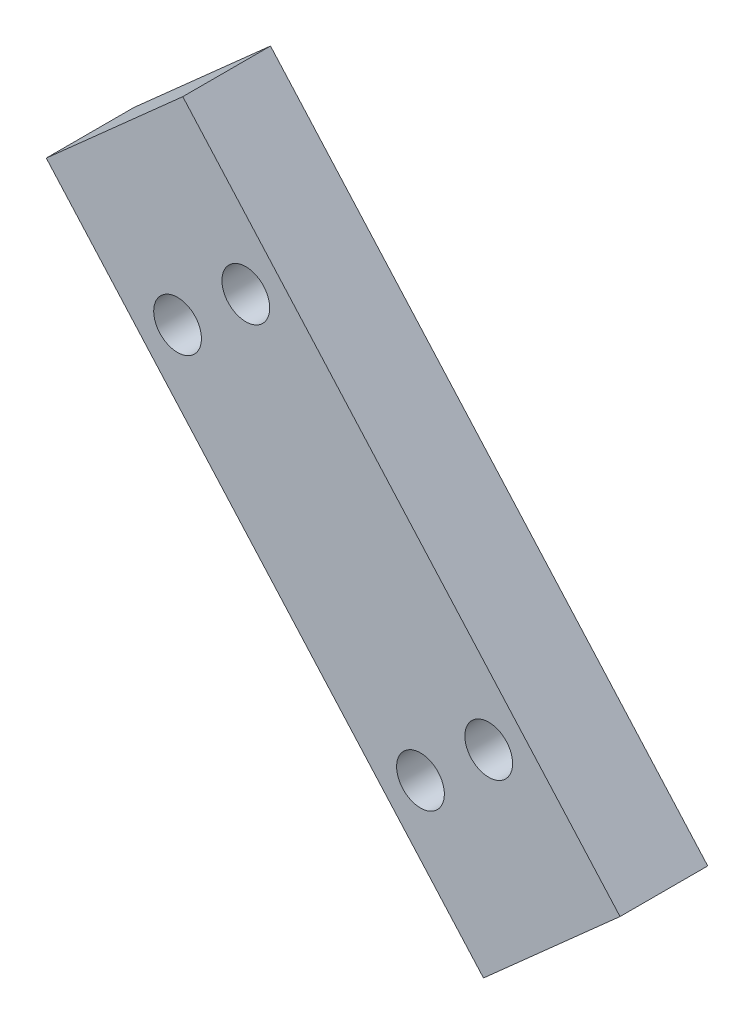
ISO-10303-21;
HEADER;
FILE_DESCRIPTION(('STEP AP214'),'2;1');
FILE_NAME('part.step','',(''),(''),'','','');
FILE_SCHEMA(('AUTOMOTIVE_DESIGN { 1 0 10303 214 1 1 1 1 }'));
ENDSEC;
DATA;
#1=APPLICATION_CONTEXT('core data for automotive mechanical design processes');
#2=APPLICATION_PROTOCOL_DEFINITION('international standard','automotive_design',2000,#1);
#3=PRODUCT_CONTEXT('',#1,'mechanical');
#4=PRODUCT('Part','Part','',(#3));
#5=PRODUCT_RELATED_PRODUCT_CATEGORY('part','',(#4));
#6=PRODUCT_DEFINITION_FORMATION('','',#4);
#7=PRODUCT_DEFINITION_CONTEXT('part definition',#1,'design');
#8=PRODUCT_DEFINITION('design','',#6,#7);
#9=PRODUCT_DEFINITION_SHAPE('','',#8);
#10=(LENGTH_UNIT() NAMED_UNIT(*) SI_UNIT(.MILLI.,.METRE.));
#11=(NAMED_UNIT(*) PLANE_ANGLE_UNIT() SI_UNIT($,.RADIAN.));
#12=(NAMED_UNIT(*) SI_UNIT($,.STERADIAN.) SOLID_ANGLE_UNIT());
#13=UNCERTAINTY_MEASURE_WITH_UNIT(LENGTH_MEASURE(1.E-05),#10,'distance_accuracy_value','');
#14=(GEOMETRIC_REPRESENTATION_CONTEXT(3) GLOBAL_UNCERTAINTY_ASSIGNED_CONTEXT((#13)) GLOBAL_UNIT_ASSIGNED_CONTEXT((#10,
#11,#12)) REPRESENTATION_CONTEXT('',''));
#15=CARTESIAN_POINT('',(0.,0.,0.));
#16=DIRECTION('',(0.,0.,1.));
#17=DIRECTION('',(1.,0.,0.));
#18=AXIS2_PLACEMENT_3D('',#15,#16,#17);
#19=CARTESIAN_POINT('',(34.7789888966398,61.6824214339985,-61.7519999999999));
#20=DIRECTION('',(0.,0.,-1.));
#21=DIRECTION('',(0.,1.,0.));
#22=AXIS2_PLACEMENT_3D('',#19,#20,#21);
#23=CYLINDRICAL_SURFACE('',#22,3.175);
#24=CARTESIAN_POINT('',(34.7789888966398,61.6824214339985,-64.0379999999999));
#25=DIRECTION('',(0.,0.,-1.));
#26=DIRECTION('',(0.,1.,0.));
#27=AXIS2_PLACEMENT_3D('',#24,#25,#26);
#28=CIRCLE('',#27,3.175);
#29=CARTESIAN_POINT('',(34.7789888966398,64.8574214339985,-64.0379999999999));
#30=VERTEX_POINT('',#29);
#31=EDGE_CURVE('E122',#30,#30,#28,.F.);
#32=ORIENTED_EDGE('',*,*,#31,.F.);
#33=EDGE_LOOP('',(#32));
#34=FACE_BOUND('',#33,.T.);
#35=CARTESIAN_POINT('',(34.7789888966398,61.6824214339985,-61.7519999999999));
#36=DIRECTION('',(0.,0.,-1.));
#37=DIRECTION('',(0.,1.,0.));
#38=AXIS2_PLACEMENT_3D('',#35,#36,#37);
#39=CIRCLE('',#38,3.175);
#40=CARTESIAN_POINT('',(34.7789888966398,64.8574214339985,-61.7519999999999));
#41=VERTEX_POINT('',#40);
#42=EDGE_CURVE('E114',#41,#41,#39,.T.);
#43=ORIENTED_EDGE('',*,*,#42,.F.);
#44=EDGE_LOOP('',(#43));
#45=FACE_BOUND('',#44,.T.);
#46=ADVANCED_FACE('F16',(#34,#45),#23,.F.);
#47=CARTESIAN_POINT('',(60.1040512370988,33.217509393877,-61.7519999999999));
#48=DIRECTION('',(0.,0.,-1.));
#49=DIRECTION('',(0.,1.,0.));
#50=AXIS2_PLACEMENT_3D('',#47,#48,#49);
#51=CYLINDRICAL_SURFACE('',#50,3.175);
#52=CARTESIAN_POINT('',(60.1040512370988,33.217509393877,-64.0379999999999));
#53=DIRECTION('',(0.,0.,-1.));
#54=DIRECTION('',(0.,1.,0.));
#55=AXIS2_PLACEMENT_3D('',#52,#53,#54);
#56=CIRCLE('',#55,3.175);
#57=CARTESIAN_POINT('',(60.1040512370988,36.392509393877,-64.0379999999999));
#58=VERTEX_POINT('',#57);
#59=EDGE_CURVE('E19',#58,#58,#56,.F.);
#60=ORIENTED_EDGE('',*,*,#59,.F.);
#61=EDGE_LOOP('',(#60));
#62=FACE_BOUND('',#61,.T.);
#63=CARTESIAN_POINT('',(60.1040512370988,33.217509393877,-61.7519999999999));
#64=DIRECTION('',(0.,0.,-1.));
#65=DIRECTION('',(0.,1.,0.));
#66=AXIS2_PLACEMENT_3D('',#63,#64,#65);
#67=CIRCLE('',#66,3.175);
#68=CARTESIAN_POINT('',(60.1040512370988,36.392509393877,-61.7519999999999));
#69=VERTEX_POINT('',#68);
#70=EDGE_CURVE('E111',#69,#69,#67,.T.);
#71=ORIENTED_EDGE('',*,*,#70,.F.);
#72=EDGE_LOOP('',(#71));
#73=FACE_BOUND('',#72,.T.);
#74=ADVANCED_FACE('F130',(#62,#73),#51,.F.);
#75=CARTESIAN_POINT('',(27.6627608866094,55.3511558488835,-64.0379999999999));
#76=DIRECTION('',(0.,0.,-1.));
#77=DIRECTION('',(0.,1.,0.));
#78=AXIS2_PLACEMENT_3D('',#75,#76,#77);
#79=CYLINDRICAL_SURFACE('',#78,4.191);
#80=CARTESIAN_POINT('',(27.6627608866094,55.3511558488834,-59.2119999999999));
#81=DIRECTION('',(0.,0.,-1.));
#82=DIRECTION('',(0.,1.,0.));
#83=AXIS2_PLACEMENT_3D('',#80,#81,#82);
#84=CIRCLE('',#83,4.191);
#85=CARTESIAN_POINT('',(27.6627608866094,59.5421558488834,-59.2119999999999));
#86=VERTEX_POINT('',#85);
#87=EDGE_CURVE('E108',#86,#86,#84,.F.);
#88=ORIENTED_EDGE('',*,*,#87,.T.);
#89=EDGE_LOOP('',(#88));
#90=FACE_BOUND('',#89,.T.);
#91=CARTESIAN_POINT('',(27.6627608866094,55.3511558488835,-64.0379999999999));
#92=DIRECTION('',(0.,0.,-1.));
#93=DIRECTION('',(0.,1.,0.));
#94=AXIS2_PLACEMENT_3D('',#91,#92,#93);
#95=CIRCLE('',#94,4.191);
#96=CARTESIAN_POINT('',(27.6627608866094,59.5421558488834,-64.0379999999999));
#97=VERTEX_POINT('',#96);
#98=EDGE_CURVE('E120',#97,#97,#95,.F.);
#99=ORIENTED_EDGE('',*,*,#98,.F.);
#100=EDGE_LOOP('',(#99));
#101=FACE_BOUND('',#100,.T.);
#102=ADVANCED_FACE('F133',(#90,#101),#79,.F.);
#103=CARTESIAN_POINT('',(52.9878232270687,26.8862438087622,-64.0379999999999));
#104=DIRECTION('',(0.,0.,-1.));
#105=DIRECTION('',(0.,1.,0.));
#106=AXIS2_PLACEMENT_3D('',#103,#104,#105);
#107=CYLINDRICAL_SURFACE('',#106,4.191);
#108=CARTESIAN_POINT('',(52.9878232270687,26.8862438087622,-59.2119999999999));
#109=DIRECTION('',(0.,0.,-1.));
#110=DIRECTION('',(0.,1.,0.));
#111=AXIS2_PLACEMENT_3D('',#108,#109,#110);
#112=CIRCLE('',#111,4.191);
#113=CARTESIAN_POINT('',(52.9878232270687,31.0772438087622,-59.2119999999999));
#114=VERTEX_POINT('',#113);
#115=EDGE_CURVE('E75',#114,#114,#112,.F.);
#116=ORIENTED_EDGE('',*,*,#115,.T.);
#117=EDGE_LOOP('',(#116));
#118=FACE_BOUND('',#117,.T.);
#119=CARTESIAN_POINT('',(52.9878232270687,26.8862438087622,-64.0379999999999));
#120=DIRECTION('',(0.,0.,-1.));
#121=DIRECTION('',(0.,1.,0.));
#122=AXIS2_PLACEMENT_3D('',#119,#120,#121);
#123=CIRCLE('',#122,4.191);
#124=CARTESIAN_POINT('',(52.9878232270687,31.0772438087622,-64.0379999999999));
#125=VERTEX_POINT('',#124);
#126=EDGE_CURVE('E117',#125,#125,#123,.F.);
#127=ORIENTED_EDGE('',*,*,#126,.F.);
#128=EDGE_LOOP('',(#127));
#129=FACE_BOUND('',#128,.T.);
#130=ADVANCED_FACE('F195',(#118,#129),#107,.F.);
#131=CARTESIAN_POINT('',(59.559734158237,12.3346462001562,-64.0379999999999));
#132=DIRECTION('',(0.,0.,-1.));
#133=DIRECTION('',(0.,1.,0.));
#134=AXIS2_PLACEMENT_3D('',#131,#132,#133);
#135=PLANE('',#134);
#136=ORIENTED_EDGE('',*,*,#126,.T.);
#137=EDGE_LOOP('',(#136));
#138=FACE_BOUND('',#137,.T.);
#139=ORIENTED_EDGE('',*,*,#98,.T.);
#140=EDGE_LOOP('',(#139));
#141=FACE_BOUND('',#140,.T.);
#142=ORIENTED_EDGE('',*,*,#31,.T.);
#143=EDGE_LOOP('',(#142));
#144=FACE_BOUND('',#143,.T.);
#145=ORIENTED_EDGE('',*,*,#59,.T.);
#146=EDGE_LOOP('',(#145));
#147=FACE_BOUND('',#146,.T.);
#148=DIRECTION('',(-0.664699798962186,0.747110552234159,0.));
#149=VECTOR('',#148,1.);
#150=CARTESIAN_POINT('',(28.2070779654714,76.2340190426044,-64.0379999999999));
#151=LINE('',#150,#149);
#152=CARTESIAN_POINT('',(73.7921901782979,24.9971773703857,-64.0379999999999));
#153=VERTEX_POINT('',#152);
#154=CARTESIAN_POINT('',(28.2070779654714,76.2340190426044,-64.0379999999998));
#155=VERTEX_POINT('',#154);
#156=EDGE_CURVE('E58',#153,#155,#151,.T.);
#157=ORIENTED_EDGE('',*,*,#156,.F.);
#158=DIRECTION('',(0.747110552234159,0.664699798962186,0.));
#159=VECTOR('',#158,1.);
#160=CARTESIAN_POINT('',(73.7921901782978,24.9971773703857,-64.0379999999999));
#161=LINE('',#160,#159);
#162=CARTESIAN_POINT('',(59.5597341582371,12.3346462001562,-64.0379999999999));
#163=VERTEX_POINT('',#162);
#164=EDGE_CURVE('E53',#163,#153,#161,.T.);
#165=ORIENTED_EDGE('',*,*,#164,.F.);
#166=DIRECTION('',(0.664699798962186,-0.747110552234159,0.));
#167=VECTOR('',#166,1.);
#168=CARTESIAN_POINT('',(13.9746219454103,63.571487872375,-64.0379999999999));
#169=LINE('',#168,#167);
#170=CARTESIAN_POINT('',(13.9746219454103,63.5714878723749,-64.0379999999999));
#171=VERTEX_POINT('',#170);
#172=EDGE_CURVE('E71',#171,#163,#169,.T.);
#173=ORIENTED_EDGE('',*,*,#172,.F.);
#174=DIRECTION('',(-0.747110552234159,-0.664699798962186,0.));
#175=VECTOR('',#174,1.);
#176=CARTESIAN_POINT('',(28.2070779654714,76.2340190426044,-64.0379999999999));
#177=LINE('',#176,#175);
#178=EDGE_CURVE('E67',#155,#171,#177,.T.);
#179=ORIENTED_EDGE('',*,*,#178,.F.);
#180=EDGE_LOOP('',(#157,#165,#173,#179));
#181=FACE_BOUND('',#180,.T.);
#182=ADVANCED_FACE('F70',(#138,#141,#144,#147,#181),#135,.T.);
#183=CARTESIAN_POINT('',(34.7789888966398,61.6824214339985,-61.7519999999999));
#184=DIRECTION('',(0.,0.,-1.));
#185=DIRECTION('',(0.,1.,0.));
#186=AXIS2_PLACEMENT_3D('',#183,#184,#185);
#187=PLANE('',#186);
#188=CARTESIAN_POINT('',(34.7789888966398,61.6824214339985,-61.7519999999999));
#189=DIRECTION('',(0.,0.,-1.));
#190=DIRECTION('',(0.,1.,0.));
#191=AXIS2_PLACEMENT_3D('',#188,#189,#190);
#192=CIRCLE('',#191,2.4892);
#193=CARTESIAN_POINT('',(34.7789888966398,64.1716214339985,-61.7519999999999));
#194=VERTEX_POINT('',#193);
#195=EDGE_CURVE('E102',#194,#194,#192,.F.);
#196=ORIENTED_EDGE('',*,*,#195,.T.);
#197=EDGE_LOOP('',(#196));
#198=FACE_BOUND('',#197,.T.);
#199=ORIENTED_EDGE('',*,*,#42,.T.);
#200=EDGE_LOOP('',(#199));
#201=FACE_BOUND('',#200,.T.);
#202=ADVANCED_FACE('F139',(#198,#201),#187,.T.);
#203=CARTESIAN_POINT('',(60.1040512370988,33.217509393877,-61.7519999999999));
#204=DIRECTION('',(0.,0.,-1.));
#205=DIRECTION('',(0.,1.,0.));
#206=AXIS2_PLACEMENT_3D('',#203,#204,#205);
#207=PLANE('',#206);
#208=CARTESIAN_POINT('',(60.1040512370988,33.217509393877,-61.7519999999999));
#209=DIRECTION('',(0.,0.,-1.));
#210=DIRECTION('',(0.,1.,0.));
#211=AXIS2_PLACEMENT_3D('',#208,#209,#210);
#212=CIRCLE('',#211,2.4892);
#213=CARTESIAN_POINT('',(60.1040512370988,35.706709393877,-61.7519999999999));
#214=VERTEX_POINT('',#213);
#215=EDGE_CURVE('E99',#214,#214,#212,.F.);
#216=ORIENTED_EDGE('',*,*,#215,.T.);
#217=EDGE_LOOP('',(#216));
#218=FACE_BOUND('',#217,.T.);
#219=ORIENTED_EDGE('',*,*,#70,.T.);
#220=EDGE_LOOP('',(#219));
#221=FACE_BOUND('',#220,.T.);
#222=ADVANCED_FACE('F136',(#218,#221),#207,.T.);
#223=CARTESIAN_POINT('',(29.317331626186,53.4914482622624,-59.2119999999999));
#224=DIRECTION('',(0.,0.,1.));
#225=DIRECTION('',(0.,-1.,0.));
#226=AXIS2_PLACEMENT_3D('',#223,#224,#225);
#227=PLANE('',#226);
#228=CARTESIAN_POINT('',(27.6627608866094,55.3511558488834,-59.2119999999999));
#229=DIRECTION('',(0.,0.,-1.));
#230=DIRECTION('',(0.,1.,0.));
#231=AXIS2_PLACEMENT_3D('',#228,#229,#230);
#232=CIRCLE('',#231,2.4892);
#233=CARTESIAN_POINT('',(27.6627608866094,57.8403558488834,-59.2119999999999));
#234=VERTEX_POINT('',#233);
#235=EDGE_CURVE('E96',#234,#234,#232,.F.);
#236=ORIENTED_EDGE('',*,*,#235,.T.);
#237=EDGE_LOOP('',(#236));
#238=FACE_BOUND('',#237,.T.);
#239=ORIENTED_EDGE('',*,*,#87,.F.);
#240=EDGE_LOOP('',(#239));
#241=FACE_BOUND('',#240,.T.);
#242=ADVANCED_FACE('F138',(#238,#241),#227,.F.);
#243=CARTESIAN_POINT('',(54.6423939666453,25.0265362221408,-59.2119999999999));
#244=DIRECTION('',(0.,0.,1.));
#245=DIRECTION('',(0.,-1.,0.));
#246=AXIS2_PLACEMENT_3D('',#243,#244,#245);
#247=PLANE('',#246);
#248=CARTESIAN_POINT('',(52.9878232270687,26.8862438087622,-59.2119999999999));
#249=DIRECTION('',(0.,0.,-1.));
#250=DIRECTION('',(0.,1.,0.));
#251=AXIS2_PLACEMENT_3D('',#248,#249,#250);
#252=CIRCLE('',#251,2.4892);
#253=CARTESIAN_POINT('',(52.9878232270687,29.3754438087622,-59.2119999999999));
#254=VERTEX_POINT('',#253);
#255=EDGE_CURVE('E93',#254,#254,#252,.F.);
#256=ORIENTED_EDGE('',*,*,#255,.T.);
#257=EDGE_LOOP('',(#256));
#258=FACE_BOUND('',#257,.T.);
#259=ORIENTED_EDGE('',*,*,#115,.F.);
#260=EDGE_LOOP('',(#259));
#261=FACE_BOUND('',#260,.T.);
#262=ADVANCED_FACE('F147',(#258,#261),#247,.F.);
#263=CARTESIAN_POINT('',(28.2070779654714,76.2340190426044,-54.8939999999999));
#264=DIRECTION('',(-0.664699798962186,0.747110552234159,0.));
#265=DIRECTION('',(-0.747110552234159,-0.664699798962186,0.));
#266=AXIS2_PLACEMENT_3D('',#263,#264,#265);
#267=PLANE('',#266);
#268=DIRECTION('',(0.747110552234175,0.664699798962168,0.));
#269=VECTOR('',#268,1.);
#270=CARTESIAN_POINT('',(13.9746219454103,63.571487872375,-54.8939999999998));
#271=LINE('',#270,#269);
#272=CARTESIAN_POINT('',(13.9746219454104,63.5714878723748,-54.8939999999999));
#273=VERTEX_POINT('',#272);
#274=CARTESIAN_POINT('',(28.2070779654714,76.2340190426044,-54.8939999999999));
#275=VERTEX_POINT('',#274);
#276=EDGE_CURVE('E79',#273,#275,#271,.T.);
#277=ORIENTED_EDGE('',*,*,#276,.T.);
#278=DIRECTION('',(0.,0.,1.));
#279=VECTOR('',#278,1.);
#280=CARTESIAN_POINT('',(28.2070779654714,76.2340190426044,-54.8939999999999));
#281=LINE('',#280,#279);
#282=EDGE_CURVE('E63',#155,#275,#281,.T.);
#283=ORIENTED_EDGE('',*,*,#282,.F.);
#284=ORIENTED_EDGE('',*,*,#178,.T.);
#285=DIRECTION('',(0.,0.,1.));
#286=VECTOR('',#285,1.);
#287=CARTESIAN_POINT('',(13.9746219454103,63.571487872375,-54.8939999999999));
#288=LINE('',#287,#286);
#289=EDGE_CURVE('E105',#273,#171,#288,.F.);
#290=ORIENTED_EDGE('',*,*,#289,.F.);
#291=EDGE_LOOP('',(#277,#283,#284,#290));
#292=FACE_BOUND('',#291,.T.);
#293=ADVANCED_FACE('F78',(#292),#267,.T.);
#294=CARTESIAN_POINT('',(28.2070779654714,76.2340190426044,-54.8939999999999));
#295=DIRECTION('',(0.747110552234159,0.664699798962186,0.));
#296=DIRECTION('',(-0.664699798962186,0.747110552234159,0.));
#297=AXIS2_PLACEMENT_3D('',#294,#295,#296);
#298=PLANE('',#297);
#299=DIRECTION('',(0.664699798962183,-0.747110552234161,0.));
#300=VECTOR('',#299,1.);
#301=CARTESIAN_POINT('',(28.2070779654714,76.2340190426044,-54.8939999999998));
#302=LINE('',#301,#300);
#303=CARTESIAN_POINT('',(73.7921901782979,24.9971773703858,-54.8939999999999));
#304=VERTEX_POINT('',#303);
#305=EDGE_CURVE('E356',#275,#304,#302,.T.);
#306=ORIENTED_EDGE('',*,*,#305,.T.);
#307=DIRECTION('',(0.,0.,1.));
#308=VECTOR('',#307,1.);
#309=CARTESIAN_POINT('',(73.7921901782978,24.9971773703857,-54.8939999999999));
#310=LINE('',#309,#308);
#311=EDGE_CURVE('E65',#153,#304,#310,.T.);
#312=ORIENTED_EDGE('',*,*,#311,.F.);
#313=ORIENTED_EDGE('',*,*,#156,.T.);
#314=ORIENTED_EDGE('',*,*,#282,.T.);
#315=EDGE_LOOP('',(#306,#312,#313,#314));
#316=FACE_BOUND('',#315,.T.);
#317=ADVANCED_FACE('F61',(#316),#298,.T.);
#318=CARTESIAN_POINT('',(73.7921901782978,24.9971773703857,-54.8939999999999));
#319=DIRECTION('',(0.664699798962186,-0.747110552234159,0.));
#320=DIRECTION('',(0.747110552234159,0.664699798962186,0.));
#321=AXIS2_PLACEMENT_3D('',#318,#319,#320);
#322=PLANE('',#321);
#323=DIRECTION('',(-0.747110552234162,-0.664699798962182,0.));
#324=VECTOR('',#323,1.);
#325=CARTESIAN_POINT('',(73.7921901782978,24.9971773703857,-54.8939999999999));
#326=LINE('',#325,#324);
#327=CARTESIAN_POINT('',(59.5597341582371,12.3346462001561,-54.8939999999999));
#328=VERTEX_POINT('',#327);
#329=EDGE_CURVE('E354',#304,#328,#326,.T.);
#330=ORIENTED_EDGE('',*,*,#329,.T.);
#331=DIRECTION('',(0.,0.,1.));
#332=VECTOR('',#331,1.);
#333=CARTESIAN_POINT('',(59.5597341582371,12.3346462001562,-54.8939999999999));
#334=LINE('',#333,#332);
#335=EDGE_CURVE('E34',#163,#328,#334,.T.);
#336=ORIENTED_EDGE('',*,*,#335,.F.);
#337=ORIENTED_EDGE('',*,*,#164,.T.);
#338=ORIENTED_EDGE('',*,*,#311,.T.);
#339=EDGE_LOOP('',(#330,#336,#337,#338));
#340=FACE_BOUND('',#339,.T.);
#341=ADVANCED_FACE('F180',(#340),#322,.T.);
#342=CARTESIAN_POINT('',(13.9746219454103,63.571487872375,-54.8939999999999));
#343=DIRECTION('',(-0.747110552234159,-0.664699798962186,0.));
#344=DIRECTION('',(0.664699798962186,-0.747110552234159,0.));
#345=AXIS2_PLACEMENT_3D('',#342,#343,#344);
#346=PLANE('',#345);
#347=DIRECTION('',(-0.664699798962185,0.74711055223416,0.));
#348=VECTOR('',#347,1.);
#349=CARTESIAN_POINT('',(59.559734158237,12.3346462001562,-54.8939999999999));
#350=LINE('',#349,#348);
#351=EDGE_CURVE('E92',#328,#273,#350,.T.);
#352=ORIENTED_EDGE('',*,*,#351,.T.);
#353=ORIENTED_EDGE('',*,*,#289,.T.);
#354=ORIENTED_EDGE('',*,*,#172,.T.);
#355=ORIENTED_EDGE('',*,*,#335,.T.);
#356=EDGE_LOOP('',(#352,#353,#354,#355));
#357=FACE_BOUND('',#356,.T.);
#358=ADVANCED_FACE('F176',(#357),#346,.T.);
#359=CARTESIAN_POINT('',(34.7789888966398,61.6824214339985,-64.0379999999999));
#360=DIRECTION('',(0.,0.,-1.));
#361=DIRECTION('',(0.,1.,0.));
#362=AXIS2_PLACEMENT_3D('',#359,#360,#361);
#363=CYLINDRICAL_SURFACE('',#362,2.4892);
#364=CARTESIAN_POINT('',(34.7789888966398,61.6824214339985,-54.8939999999999));
#365=DIRECTION('',(0.,0.,-1.));
#366=DIRECTION('',(0.,1.,0.));
#367=AXIS2_PLACEMENT_3D('',#364,#365,#366);
#368=CIRCLE('',#367,2.4892);
#369=CARTESIAN_POINT('',(34.7789888966398,64.1716214339985,-54.8939999999999));
#370=VERTEX_POINT('',#369);
#371=EDGE_CURVE('E89',#370,#370,#368,.F.);
#372=ORIENTED_EDGE('',*,*,#371,.T.);
#373=EDGE_LOOP('',(#372));
#374=FACE_BOUND('',#373,.T.);
#375=ORIENTED_EDGE('',*,*,#195,.F.);
#376=EDGE_LOOP('',(#375));
#377=FACE_BOUND('',#376,.T.);
#378=ADVANCED_FACE('F172',(#374,#377),#363,.F.);
#379=CARTESIAN_POINT('',(60.1040512370988,33.217509393877,-64.0379999999999));
#380=DIRECTION('',(0.,0.,-1.));
#381=DIRECTION('',(0.,1.,0.));
#382=AXIS2_PLACEMENT_3D('',#379,#380,#381);
#383=CYLINDRICAL_SURFACE('',#382,2.4892);
#384=CARTESIAN_POINT('',(60.1040512370988,33.217509393877,-54.8939999999999));
#385=DIRECTION('',(0.,0.,-1.));
#386=DIRECTION('',(0.,1.,0.));
#387=AXIS2_PLACEMENT_3D('',#384,#385,#386);
#388=CIRCLE('',#387,2.4892);
#389=CARTESIAN_POINT('',(60.1040512370988,35.706709393877,-54.8939999999999));
#390=VERTEX_POINT('',#389);
#391=EDGE_CURVE('E86',#390,#390,#388,.F.);
#392=ORIENTED_EDGE('',*,*,#391,.T.);
#393=EDGE_LOOP('',(#392));
#394=FACE_BOUND('',#393,.T.);
#395=ORIENTED_EDGE('',*,*,#215,.F.);
#396=EDGE_LOOP('',(#395));
#397=FACE_BOUND('',#396,.T.);
#398=ADVANCED_FACE('F168',(#394,#397),#383,.F.);
#399=CARTESIAN_POINT('',(27.6627608866094,55.3511558488835,-64.0379999999999));
#400=DIRECTION('',(0.,0.,-1.));
#401=DIRECTION('',(0.,1.,0.));
#402=AXIS2_PLACEMENT_3D('',#399,#400,#401);
#403=CYLINDRICAL_SURFACE('',#402,2.4892);
#404=CARTESIAN_POINT('',(27.6627608866094,55.3511558488834,-54.8939999999999));
#405=DIRECTION('',(0.,0.,-1.));
#406=DIRECTION('',(0.,1.,0.));
#407=AXIS2_PLACEMENT_3D('',#404,#405,#406);
#408=CIRCLE('',#407,2.4892);
#409=CARTESIAN_POINT('',(27.6627608866094,57.8403558488834,-54.8939999999999));
#410=VERTEX_POINT('',#409);
#411=EDGE_CURVE('E25',#410,#410,#408,.F.);
#412=ORIENTED_EDGE('',*,*,#411,.T.);
#413=EDGE_LOOP('',(#412));
#414=FACE_BOUND('',#413,.T.);
#415=ORIENTED_EDGE('',*,*,#235,.F.);
#416=EDGE_LOOP('',(#415));
#417=FACE_BOUND('',#416,.T.);
#418=ADVANCED_FACE('F160',(#414,#417),#403,.F.);
#419=CARTESIAN_POINT('',(52.9878232270687,26.8862438087622,-64.0379999999999));
#420=DIRECTION('',(0.,0.,-1.));
#421=DIRECTION('',(0.,1.,0.));
#422=AXIS2_PLACEMENT_3D('',#419,#420,#421);
#423=CYLINDRICAL_SURFACE('',#422,2.4892);
#424=CARTESIAN_POINT('',(52.9878232270687,26.8862438087622,-54.8939999999999));
#425=DIRECTION('',(0.,0.,-1.));
#426=DIRECTION('',(0.,1.,0.));
#427=AXIS2_PLACEMENT_3D('',#424,#425,#426);
#428=CIRCLE('',#427,2.4892);
#429=CARTESIAN_POINT('',(52.9878232270687,29.3754438087622,-54.8939999999999));
#430=VERTEX_POINT('',#429);
#431=EDGE_CURVE('E11',#430,#430,#428,.F.);
#432=ORIENTED_EDGE('',*,*,#431,.T.);
#433=EDGE_LOOP('',(#432));
#434=FACE_BOUND('',#433,.T.);
#435=ORIENTED_EDGE('',*,*,#255,.F.);
#436=EDGE_LOOP('',(#435));
#437=FACE_BOUND('',#436,.T.);
#438=ADVANCED_FACE('F154',(#434,#437),#423,.F.);
#439=CARTESIAN_POINT('',(59.559734158237,12.3346462001562,-54.8939999999999));
#440=DIRECTION('',(0.,0.,-1.));
#441=DIRECTION('',(0.,1.,0.));
#442=AXIS2_PLACEMENT_3D('',#439,#440,#441);
#443=PLANE('',#442);
#444=ORIENTED_EDGE('',*,*,#431,.F.);
#445=EDGE_LOOP('',(#444));
#446=FACE_BOUND('',#445,.T.);
#447=ORIENTED_EDGE('',*,*,#411,.F.);
#448=EDGE_LOOP('',(#447));
#449=FACE_BOUND('',#448,.T.);
#450=ORIENTED_EDGE('',*,*,#391,.F.);
#451=EDGE_LOOP('',(#450));
#452=FACE_BOUND('',#451,.T.);
#453=ORIENTED_EDGE('',*,*,#371,.F.);
#454=EDGE_LOOP('',(#453));
#455=FACE_BOUND('',#454,.T.);
#456=ORIENTED_EDGE('',*,*,#329,.F.);
#457=ORIENTED_EDGE('',*,*,#305,.F.);
#458=ORIENTED_EDGE('',*,*,#276,.F.);
#459=ORIENTED_EDGE('',*,*,#351,.F.);
#460=EDGE_LOOP('',(#456,#457,#458,#459));
#461=FACE_BOUND('',#460,.T.);
#462=ADVANCED_FACE('F152',(#446,#449,#452,#455,#461),#443,.F.);
#463=CLOSED_SHELL('',(#46,#74,#102,#130,#182,#202,#222,#242,#262,#293,#317,#341,#358,#378,#398,
#418,#438,#462));
#464=MANIFOLD_SOLID_BREP('B1',#463);
#465=ADVANCED_BREP_SHAPE_REPRESENTATION('',(#18,#464),#14);
#466=SHAPE_DEFINITION_REPRESENTATION(#9,#465);
ENDSEC;
END-ISO-10303-21;
